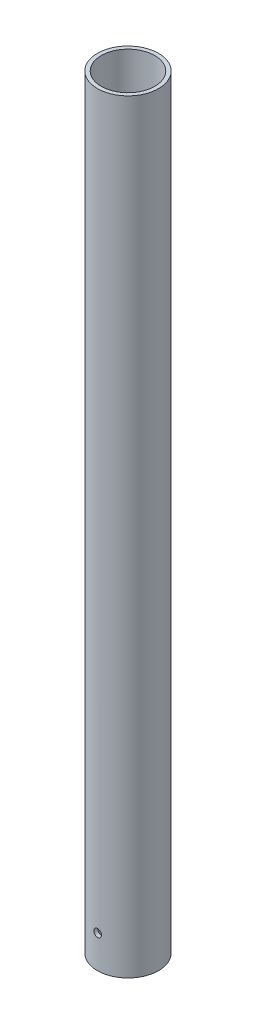
ISO-10303-21;
HEADER;
FILE_DESCRIPTION(('STEP AP214'),'2;1');
FILE_NAME('part.step','',(''),(''),'','','');
FILE_SCHEMA(('AUTOMOTIVE_DESIGN { 1 0 10303 214 1 1 1 1 }'));
ENDSEC;
DATA;
#1=APPLICATION_CONTEXT('core data for automotive mechanical design processes');
#2=APPLICATION_PROTOCOL_DEFINITION('international standard','automotive_design',2000,#1);
#3=PRODUCT_CONTEXT('',#1,'mechanical');
#4=PRODUCT('Part','Part','',(#3));
#5=PRODUCT_RELATED_PRODUCT_CATEGORY('part','',(#4));
#6=PRODUCT_DEFINITION_FORMATION('','',#4);
#7=PRODUCT_DEFINITION_CONTEXT('part definition',#1,'design');
#8=PRODUCT_DEFINITION('design','',#6,#7);
#9=PRODUCT_DEFINITION_SHAPE('','',#8);
#10=(LENGTH_UNIT() NAMED_UNIT(*) SI_UNIT(.MILLI.,.METRE.));
#11=(NAMED_UNIT(*) PLANE_ANGLE_UNIT() SI_UNIT($,.RADIAN.));
#12=(NAMED_UNIT(*) SI_UNIT($,.STERADIAN.) SOLID_ANGLE_UNIT());
#13=UNCERTAINTY_MEASURE_WITH_UNIT(LENGTH_MEASURE(1.E-05),#10,'distance_accuracy_value','');
#14=(GEOMETRIC_REPRESENTATION_CONTEXT(3) GLOBAL_UNCERTAINTY_ASSIGNED_CONTEXT((#13)) GLOBAL_UNIT_ASSIGNED_CONTEXT((#10,
#11,#12)) REPRESENTATION_CONTEXT('',''));
#15=CARTESIAN_POINT('',(0.,0.,0.));
#16=DIRECTION('',(0.,0.,1.));
#17=DIRECTION('',(1.,0.,0.));
#18=AXIS2_PLACEMENT_3D('',#15,#16,#17);
#19=CARTESIAN_POINT('',(0.,200.,0.));
#20=DIRECTION('',(0.,1.,0.));
#21=DIRECTION('',(0.,0.,1.));
#22=AXIS2_PLACEMENT_3D('',#19,#20,#21);
#23=PLANE('',#22);
#24=CARTESIAN_POINT('',(0.,200.,0.));
#25=DIRECTION('',(0.,1.,0.));
#26=DIRECTION('',(0.,0.,1.));
#27=AXIS2_PLACEMENT_3D('',#24,#25,#26);
#28=CIRCLE('',#27,8.);
#29=CARTESIAN_POINT('',(0.,200.,8.));
#30=VERTEX_POINT('',#29);
#31=EDGE_CURVE('E10',#30,#30,#28,.T.);
#32=ORIENTED_EDGE('',*,*,#31,.T.);
#33=EDGE_LOOP('',(#32));
#34=FACE_BOUND('',#33,.T.);
#35=CARTESIAN_POINT('',(0.,200.,0.));
#36=DIRECTION('',(0.,1.,0.));
#37=DIRECTION('',(0.,0.,1.));
#38=AXIS2_PLACEMENT_3D('',#35,#36,#37);
#39=CIRCLE('',#38,7.);
#40=CARTESIAN_POINT('',(0.,200.,7.));
#41=VERTEX_POINT('',#40);
#42=EDGE_CURVE('E52',#41,#41,#39,.T.);
#43=ORIENTED_EDGE('',*,*,#42,.F.);
#44=EDGE_LOOP('',(#43));
#45=FACE_BOUND('',#44,.T.);
#46=ADVANCED_FACE('F33',(#34,#45),#23,.T.);
#47=CARTESIAN_POINT('',(0.,0.,0.));
#48=DIRECTION('',(0.,1.,0.));
#49=DIRECTION('',(0.,0.,1.));
#50=AXIS2_PLACEMENT_3D('',#47,#48,#49);
#51=PLANE('',#50);
#52=CARTESIAN_POINT('',(0.,0.,0.));
#53=DIRECTION('',(0.,1.,0.));
#54=DIRECTION('',(0.,0.,1.));
#55=AXIS2_PLACEMENT_3D('',#52,#53,#54);
#56=CIRCLE('',#55,8.);
#57=CARTESIAN_POINT('',(0.,0.,8.));
#58=VERTEX_POINT('',#57);
#59=EDGE_CURVE('E47',#58,#58,#56,.T.);
#60=ORIENTED_EDGE('',*,*,#59,.F.);
#61=EDGE_LOOP('',(#60));
#62=FACE_BOUND('',#61,.T.);
#63=CARTESIAN_POINT('',(0.,0.,0.));
#64=DIRECTION('',(0.,1.,0.));
#65=DIRECTION('',(0.,0.,1.));
#66=AXIS2_PLACEMENT_3D('',#63,#64,#65);
#67=CIRCLE('',#66,7.);
#68=CARTESIAN_POINT('',(0.,0.,7.));
#69=VERTEX_POINT('',#68);
#70=EDGE_CURVE('E55',#69,#69,#67,.T.);
#71=ORIENTED_EDGE('',*,*,#70,.T.);
#72=EDGE_LOOP('',(#71));
#73=FACE_BOUND('',#72,.T.);
#74=ADVANCED_FACE('F91',(#62,#73),#51,.F.);
#75=CARTESIAN_POINT('',(0.,200.,0.));
#76=DIRECTION('',(0.,-1.,0.));
#77=DIRECTION('',(0.,0.,-1.));
#78=AXIS2_PLACEMENT_3D('',#75,#76,#77);
#79=CYLINDRICAL_SURFACE('',#78,8.);
#80=CARTESIAN_POINT('',(0.,9.56358164041707,-8.));
#81=CARTESIAN_POINT('',(-0.0559364382223049,9.56357926404278,-7.99999921958571));
#82=CARTESIAN_POINT('',(-0.1119078297211,9.55887248874936,-7.99940713821961));
#83=CARTESIAN_POINT('',(-0.222293120835902,9.54017053858876,-7.99710216044544));
#84=CARTESIAN_POINT('',(-0.276705332249498,9.52616566524772,-7.99538809376571));
#85=CARTESIAN_POINT('',(-0.382358229925222,9.48928658285144,-7.99103224417762));
#86=CARTESIAN_POINT('',(-0.433601024058456,9.46641834369313,-7.98839108582217));
#87=CARTESIAN_POINT('',(-0.531511789957215,9.41247472682916,-7.98247480351239));
#88=CARTESIAN_POINT('',(-0.578180544622548,9.38140075700479,-7.97919978833646));
#89=CARTESIAN_POINT('',(-0.665885126772527,9.31174486048124,-7.9723612852253));
#90=CARTESIAN_POINT('',(-0.706892145974851,9.27312678867858,-7.96879645876967));
#91=CARTESIAN_POINT('',(-0.781861117422998,9.18955651100242,-7.961790904039));
#92=CARTESIAN_POINT('',(-0.815822710556901,9.14460398245178,-7.95835018209707));
#93=CARTESIAN_POINT('',(-0.875844064513576,9.04945364939081,-7.95196922247834));
#94=CARTESIAN_POINT('',(-0.901876838376429,8.9992386957899,-7.94903070871164));
#95=CARTESIAN_POINT('',(-0.945129230630047,8.89510681963813,-7.94400451383073));
#96=CARTESIAN_POINT('',(-0.962349183226087,8.84119003755827,-7.94191680045254));
#97=CARTESIAN_POINT('',(-0.987399592009906,8.73148396218237,-7.93884135841445));
#98=CARTESIAN_POINT('',(-0.995278685892681,8.6757059373354,-7.93784793374698));
#99=CARTESIAN_POINT('',(-1.00157421982289,8.56361113502834,-7.93705611257117));
#100=CARTESIAN_POINT('',(-0.999991040400967,8.50729437932456,-7.93725766800603));
#101=CARTESIAN_POINT('',(-0.987446894579162,8.39605970951756,-7.93882782147901));
#102=CARTESIAN_POINT('',(-0.976539505193879,8.34113564593697,-7.94018975184131));
#103=CARTESIAN_POINT('',(-0.945740153272821,8.23390363192948,-7.94391679903051));
#104=CARTESIAN_POINT('',(-0.925848008700761,8.18159573453146,-7.94628193618289));
#105=CARTESIAN_POINT('',(-0.87758622396466,8.0809144408084,-7.9517564634586));
#106=CARTESIAN_POINT('',(-0.849193301483055,8.03255232031748,-7.95486789284578));
#107=CARTESIAN_POINT('',(-0.784752587782768,7.94125896265178,-7.96148284572239));
#108=CARTESIAN_POINT('',(-0.74870444643231,7.8983279740276,-7.96498638714265));
#109=CARTESIAN_POINT('',(-0.669679644301511,7.81880455612798,-7.9720204395617));
#110=CARTESIAN_POINT('',(-0.626656803136005,7.78225800371068,-7.97555096954756));
#111=CARTESIAN_POINT('',(-0.535062867645569,7.71689808840486,-7.98221853022341));
#112=CARTESIAN_POINT('',(-0.4864917605273,7.68808474334827,-7.98535556000602));
#113=CARTESIAN_POINT('',(-0.385144668545392,7.63900911223151,-7.99088460887432));
#114=CARTESIAN_POINT('',(-0.332367278135086,7.61874969886458,-7.99327637760615));
#115=CARTESIAN_POINT('',(-0.224123176172422,7.58739344300777,-7.99704314312025));
#116=CARTESIAN_POINT('',(-0.168656590652267,7.57629617156225,-7.99841818750348));
#117=CARTESIAN_POINT('',(-0.0570052655653988,7.56363867071285,-7.99999038564304));
#118=CARTESIAN_POINT('',(-0.000827796079442673,7.56201524347145,-8.00019534457054));
#119=CARTESIAN_POINT('',(0.110998414598999,7.56818473403945,-7.99942535202172));
#120=CARTESIAN_POINT('',(0.166647167025883,7.57597745131771,-7.99845042567285));
#121=CARTESIAN_POINT('',(0.275649803088609,7.60070552392683,-7.99543507502677));
#122=CARTESIAN_POINT('',(0.329010628169883,7.61761074577813,-7.99339816325548));
#123=CARTESIAN_POINT('',(0.432139861943363,7.66005262118224,-7.98848689240079));
#124=CARTESIAN_POINT('',(0.481908148586126,7.68558956781364,-7.98561250488249));
#125=CARTESIAN_POINT('',(0.576721808274971,7.74472289542006,-7.97932729164045));
#126=CARTESIAN_POINT('',(0.621741503977528,7.77836015633933,-7.97591377617004));
#127=CARTESIAN_POINT('',(0.705518795850528,7.85268143943076,-7.96894056930262));
#128=CARTESIAN_POINT('',(0.744276143334744,7.89336574131747,-7.96538087210759));
#129=CARTESIAN_POINT('',(0.814652783527207,7.98090460711993,-7.95849242185034));
#130=CARTESIAN_POINT('',(0.846230184227174,8.02779297894123,-7.95516509888531));
#131=CARTESIAN_POINT('',(0.901061155777403,8.12624493835896,-7.94914164414859));
#132=CARTESIAN_POINT('',(0.924314893491348,8.17780843220768,-7.94644549972411));
#133=CARTESIAN_POINT('',(0.961770631546617,8.28401176807612,-7.94199940157198));
#134=CARTESIAN_POINT('',(0.975996250982844,8.33864317243627,-7.94024698073915));
#135=CARTESIAN_POINT('',(0.995067997547139,8.44954263392934,-7.93787966362982));
#136=CARTESIAN_POINT('',(0.999914561014305,8.50581061480068,-7.93726471443511));
#137=CARTESIAN_POINT('',(1.00008261443393,8.61796921209895,-7.93724350792982));
#138=CARTESIAN_POINT('',(0.99546991907971,8.67385973974983,-7.93782889900781));
#139=CARTESIAN_POINT('',(0.976989761939731,8.78406449215511,-7.94012445814881));
#140=CARTESIAN_POINT('',(0.963122299162308,8.83837871674059,-7.94183462633232));
#141=CARTESIAN_POINT('',(0.926546829475863,8.94388042312363,-7.9461844630982));
#142=CARTESIAN_POINT('',(0.903841992388374,8.9950690184258,-7.94882379837113));
#143=CARTESIAN_POINT('',(0.850242760860124,9.0929203020364,-7.95473513297927));
#144=CARTESIAN_POINT('',(0.819348263803835,9.13958293362501,-7.95800714024165));
#145=CARTESIAN_POINT('',(0.750002532506335,9.22739413055326,-7.96484241900893));
#146=CARTESIAN_POINT('',(0.711502250309983,9.26850382479907,-7.96840748833613));
#147=CARTESIAN_POINT('',(0.628140090787353,9.34370437048426,-7.9754113263716));
#148=CARTESIAN_POINT('',(0.583276715656627,9.3777935647268,-7.97885006510236));
#149=CARTESIAN_POINT('',(0.488266248341684,9.43809578325919,-7.98522822634699));
#150=CARTESIAN_POINT('',(0.438099711838467,9.46427836277678,-7.9881657003132));
#151=CARTESIAN_POINT('',(0.334073160920512,9.50781013758359,-7.9931905963069));
#152=CARTESIAN_POINT('',(0.280217232348094,9.52516893095846,-7.9952789414783));
#153=CARTESIAN_POINT('',(0.18840230878717,9.5464053756856,-7.99786688131099));
#154=CARTESIAN_POINT('',(0.151022265406769,9.5528372172099,-7.99866290358181));
#155=CARTESIAN_POINT('',(0.0757668252849746,9.56142613869436,-7.99972972531675));
#156=CARTESIAN_POINT('',(0.0378914321984112,9.56358325017679,-8.00000052865388));
#157=CARTESIAN_POINT('',(0.,9.56358164041707,-8.));
#158=B_SPLINE_CURVE_WITH_KNOTS('',3,(#80,#81,#82,#83,#84,#85,#86,#87,#88,#89,#90,#91,#92,#93,
#94,#95,#96,#97,#98,#99,#100,#101,#102,#103,#104,#105,#106,#107,#108,#109,#110,#111,#112,#113,
#114,#115,#116,#117,#118,#119,#120,#121,#122,#123,#124,#125,#126,#127,#128,#129,#130,#131,#132,
#133,#134,#135,#136,#137,#138,#139,#140,#141,#142,#143,#144,#145,#146,#147,#148,#149,#150,#151,
#152,#153,#154,#155,#156,#157),.UNSPECIFIED.,.T.,.F.,(4,2,2,2,2,2,2,2,2,2,2,2,2,2,2,2,2,2,2,2,2,
2,2,2,2,2,2,2,2,2,2,2,2,2,2,2,2,2,4),(0.,0.167670909110499,0.335516984377371,0.503250203272708,
0.670954662364292,0.839483252807371,1.00802043120004,1.17712500127548,1.34622315798723,
1.51443690114528,1.68264387953865,1.84989078576677,2.01714108066497,2.18485370514213,
2.35257400205455,2.52145391254567,2.69033421245245,2.85927118292642,3.02820024361512,
3.19600111756768,3.36379841800772,3.53104421557358,3.69829569231579,3.86640961171369,
4.03453020550035,4.20360788603029,4.37268217688615,4.5413122971237,4.70993457204249,
4.87738760480886,5.04484065551819,5.21223369882595,5.37962883964906,5.54814095076732,
5.71669279388005,5.88588561214741,6.05489399473613,6.16847537275051,6.28205591320175),.UNSPECIFIED.);
#159=CARTESIAN_POINT('',(0.,9.56358164041707,-8.));
#160=VERTEX_POINT('',#159);
#161=EDGE_CURVE('E80',#160,#160,#158,.T.);
#162=ORIENTED_EDGE('',*,*,#161,.T.);
#163=EDGE_LOOP('',(#162));
#164=FACE_BOUND('',#163,.T.);
#165=CARTESIAN_POINT('',(1.,8.56358164041708,7.93725393319377));
#166=CARTESIAN_POINT('',(0.99999762193358,8.50764712690034,7.93725473668531));
#167=CARTESIAN_POINT('',(0.995291159608515,8.45167765445515,7.93785158047578));
#168=CARTESIAN_POINT('',(0.976590565488537,8.34129635025523,7.94017356391988));
#169=CARTESIAN_POINT('',(0.962586728436518,8.28688620821826,7.94189988257185));
#170=CARTESIAN_POINT('',(0.925710677130384,8.18123768757066,7.94628229510171));
#171=CARTESIAN_POINT('',(0.902844481919297,8.12999718356961,7.9489377578146));
#172=CARTESIAN_POINT('',(0.848905679371812,8.03209025968784,7.95487849407963));
#173=CARTESIAN_POINT('',(0.817834474949917,7.98542305971985,7.95816365993713));
#174=CARTESIAN_POINT('',(0.748181380105768,7.89771674156822,7.9650142369756));
#175=CARTESIAN_POINT('',(0.70956272600972,7.85670691948952,7.96858096680817));
#176=CARTESIAN_POINT('',(0.625990104268492,7.78173253284144,7.97558093150333));
#177=CARTESIAN_POINT('',(0.581035821623214,7.7477683187792,7.97901415971753));
#178=CARTESIAN_POINT('',(0.485883932270388,7.68774420861453,7.98537377845129));
#179=CARTESIAN_POINT('',(0.435669478224445,7.66171082237721,7.98829845538722));
#180=CARTESIAN_POINT('',(0.331538687222366,7.61845716044069,7.99329694781811));
#181=CARTESIAN_POINT('',(0.277622487744362,7.60123655764647,7.99537079489187));
#182=CARTESIAN_POINT('',(0.167918275100445,7.5761848130833,7.99842467482491));
#183=CARTESIAN_POINT('',(0.112141543865351,7.56830496900752,7.99941037934376));
#184=CARTESIAN_POINT('',(4.92802746185017E-05,7.56200748640246,8.00019627891687));
#185=CARTESIAN_POINT('',(-0.0562662307979085,7.56358947563606,7.99999652060831));
#186=CARTESIAN_POINT('',(-0.167506107589819,7.57613172152004,7.99843859108004));
#187=CARTESIAN_POINT('',(-0.222436482305781,7.58703959980962,7.99708688982291));
#188=CARTESIAN_POINT('',(-0.32968086556215,7.61784211106905,7.99338422376933));
#189=CARTESIAN_POINT('',(-0.381994824342482,7.63773691488381,7.99103323997618));
#190=CARTESIAN_POINT('',(-0.482683526175456,7.68600423753059,7.98558503123165));
#191=CARTESIAN_POINT('',(-0.531047291136208,7.71439942350915,7.98248581537295));
#192=CARTESIAN_POINT('',(-0.622342980922591,7.77884498530349,7.97588787626113));
#193=CARTESIAN_POINT('',(-0.665274656486943,7.8148957122045,7.97238913468905));
#194=CARTESIAN_POINT('',(-0.744795212309178,7.89392236785643,7.96535547009405));
#195=CARTESIAN_POINT('',(-0.781338735998399,7.93694394423574,7.96182046321891));
#196=CARTESIAN_POINT('',(-0.846693140250043,8.02853426313006,7.95513628776232));
#197=CARTESIAN_POINT('',(-0.875503996574039,8.0771030230323,7.95198712039032));
#198=CARTESIAN_POINT('',(-0.924577829433094,8.17844943864201,7.94643121045087));
#199=CARTESIAN_POINT('',(-0.944837171944931,8.23122887239835,7.94402478363252));
#200=CARTESIAN_POINT('',(-0.976192661787235,8.33947742182781,7.94023296998382));
#201=CARTESIAN_POINT('',(-0.987289250719848,8.39494640774056,7.93884753394681));
#202=CARTESIAN_POINT('',(-0.999944172763444,8.50659891321698,7.9372635551362));
#203=CARTESIAN_POINT('',(-1.00156633679931,8.56277508965259,7.9370570697695));
#204=CARTESIAN_POINT('',(-0.995394781292224,8.67459841228324,7.93783336447859));
#205=CARTESIAN_POINT('',(-0.987601262443924,8.7302455697288,7.9388161192058));
#206=CARTESIAN_POINT('',(-0.962873314319092,8.83923994584822,7.94185291393595));
#207=CARTESIAN_POINT('',(-0.945969793498425,8.89259428649324,7.94390333077864));
#208=CARTESIAN_POINT('',(-0.903533487646452,8.99571130235834,7.94884147988323));
#209=CARTESIAN_POINT('',(-0.878000399432491,9.04547385131342,7.95172924156306));
#210=CARTESIAN_POINT('',(-0.818872808861969,9.14028349794227,7.95803572541294));
#211=CARTESIAN_POINT('',(-0.785236447830843,9.18530430654284,7.96145717094833));
#212=CARTESIAN_POINT('',(-0.710916296947582,9.26908426199109,7.96843695820409));
#213=CARTESIAN_POINT('',(-0.670232232970194,9.30784316516427,7.97199530524515));
#214=CARTESIAN_POINT('',(-0.582692710223409,9.37822331535084,7.97887235474784));
#215=CARTESIAN_POINT('',(-0.535803396846813,9.40980261913507,7.98218957565009));
#216=CARTESIAN_POINT('',(-0.437349032672715,9.46463692747059,7.98818845212644));
#217=CARTESIAN_POINT('',(-0.385784076147329,9.48789209980946,7.99087012051086));
#218=CARTESIAN_POINT('',(-0.279581543655782,9.52534875518029,7.99528916261275));
#219=CARTESIAN_POINT('',(-0.224952626604711,9.53957447882972,7.99702906275082));
#220=CARTESIAN_POINT('',(-0.114058422911184,9.55864727610778,7.99937901871026));
#221=CARTESIAN_POINT('',(-0.0577932101752427,9.56349477265677,7.99998912548071));
#222=CARTESIAN_POINT('',(0.0543668733375137,9.56366560933394,8.00001051205466));
#223=CARTESIAN_POINT('',(0.110261655085894,9.55905362464426,7.99942993267136));
#224=CARTESIAN_POINT('',(0.220475096581045,9.54057339504474,7.99715136463176));
#225=CARTESIAN_POINT('',(0.27479375742394,9.52670515657237,7.99545337675258));
#226=CARTESIAN_POINT('',(0.380304577194926,9.4901263946772,7.99112994084813));
#227=CARTESIAN_POINT('',(0.431497824063828,9.46741896866778,7.98850481773788));
#228=CARTESIAN_POINT('',(0.529357334857609,9.41381311457405,7.98261779042513));
#229=CARTESIAN_POINT('',(0.576023544955212,9.3829145891124,7.97935587865248));
#230=CARTESIAN_POINT('',(0.663834707185023,9.31356435428252,7.97253277570231));
#231=CARTESIAN_POINT('',(0.70494151513372,9.27506452300761,7.96896976511568));
#232=CARTESIAN_POINT('',(0.780136447527738,9.19170446280553,7.96196063605416));
#233=CARTESIAN_POINT('',(0.814222907117396,9.14684272942071,7.95851454546799));
#234=CARTESIAN_POINT('',(0.874522097006414,9.05183367133813,7.95211524557875));
#235=CARTESIAN_POINT('',(0.900703913266694,9.00166660444304,7.94916399100913));
#236=CARTESIAN_POINT('',(0.944234115337341,8.89763894417917,7.94411143247849));
#237=CARTESIAN_POINT('',(0.961592108491325,8.84378244069572,7.94200920461551));
#238=CARTESIAN_POINT('',(0.982826358495191,8.75196964559966,7.93940314727937));
#239=CARTESIAN_POINT('',(0.989257212404232,8.71459245980204,7.93860120608764));
#240=CARTESIAN_POINT('',(0.997844822362205,8.6393427404303,7.93752632891965));
#241=CARTESIAN_POINT('',(1.00000161083973,8.60147021061669,7.93725338892971));
#242=CARTESIAN_POINT('',(1.,8.56358164041708,7.93725393319377));
#243=B_SPLINE_CURVE_WITH_KNOTS('',3,(#165,#166,#167,#168,#169,#170,#171,#172,#173,#174,#175,
#176,#177,#178,#179,#180,#181,#182,#183,#184,#185,#186,#187,#188,#189,#190,#191,#192,#193,#194,
#195,#196,#197,#198,#199,#200,#201,#202,#203,#204,#205,#206,#207,#208,#209,#210,#211,#212,#213,
#214,#215,#216,#217,#218,#219,#220,#221,#222,#223,#224,#225,#226,#227,#228,#229,#230,#231,#232,
#233,#234,#235,#236,#237,#238,#239,#240,#241,#242),.UNSPECIFIED.,.T.,.F.,(4,2,2,2,2,2,2,2,2,2,2,
2,2,2,2,2,2,2,2,2,2,2,2,2,2,2,2,2,2,2,2,2,2,2,2,2,2,2,4),(0.,0.167665126991696,
0.335505550460953,0.50323218103248,0.67093015180245,0.839466310196264,1.00801085097032,
1.17711274458296,1.34620836135932,1.51441838776583,1.68262179668044,1.84988665973216,
2.01715470268716,2.18487281765122,2.35259862587642,2.52147078951108,2.6903434824777,
2.85928786695604,3.02822410862476,3.19602087122353,3.36381405730846,3.53104150517093,
3.69827482884741,3.86639127817645,4.03451426797925,4.20359554356937,4.37267341083552,
4.54129542713977,4.70990983909125,4.87737526515302,5.04484057474716,5.21224725417636,
5.379655923857,5.54816051556335,5.71670502175932,5.88590039081934,6.05491114392807,
6.1684839585318,6.2820559114219),.UNSPECIFIED.);
#244=CARTESIAN_POINT('',(1.,8.56358164041708,7.93725393319377));
#245=VERTEX_POINT('',#244);
#246=EDGE_CURVE('E75',#245,#245,#243,.T.);
#247=ORIENTED_EDGE('',*,*,#246,.T.);
#248=EDGE_LOOP('',(#247));
#249=FACE_BOUND('',#248,.T.);
#250=ORIENTED_EDGE('',*,*,#31,.F.);
#251=EDGE_LOOP('',(#250));
#252=FACE_BOUND('',#251,.T.);
#253=ORIENTED_EDGE('',*,*,#59,.T.);
#254=EDGE_LOOP('',(#253));
#255=FACE_BOUND('',#254,.T.);
#256=ADVANCED_FACE('F35',(#164,#249,#252,#255),#79,.T.);
#257=CARTESIAN_POINT('',(0.,200.,0.));
#258=DIRECTION('',(0.,-1.,0.));
#259=DIRECTION('',(0.,0.,-1.));
#260=AXIS2_PLACEMENT_3D('',#257,#258,#259);
#261=CYLINDRICAL_SURFACE('',#260,7.);
#262=CARTESIAN_POINT('',(0.,9.56358164041707,-7.));
#263=CARTESIAN_POINT('',(-0.055865364706411,9.56357931382826,-6.99999913522882));
#264=CARTESIAN_POINT('',(-0.111763905495517,9.55888443325767,-6.99932420200296));
#265=CARTESIAN_POINT('',(-0.222000660368082,9.54023250418308,-6.99669670505877));
#266=CARTESIAN_POINT('',(-0.276337265533479,9.52626623864669,-6.99474286996306));
#267=CARTESIAN_POINT('',(-0.381838676785442,9.48949557868285,-6.98977730161823));
#268=CARTESIAN_POINT('',(-0.433005769349771,9.46669764359057,-6.98676634168295));
#269=CARTESIAN_POINT('',(-0.530779650240318,9.41292609752172,-6.98001989080586));
#270=CARTESIAN_POINT('',(-0.57738711543865,9.38195370256749,-6.97628450765023));
#271=CARTESIAN_POINT('',(-0.665058650397312,9.31247746924981,-6.96847539120891));
#272=CARTESIAN_POINT('',(-0.70608559080065,9.27392699755916,-6.96439965767478));
#273=CARTESIAN_POINT('',(-0.781111291768627,9.19048922587742,-6.95638499821218));
#274=CARTESIAN_POINT('',(-0.815109662708697,9.14560157482055,-6.95244607987804));
#275=CARTESIAN_POINT('',(-0.875255876422228,9.05051652436332,-6.94513156490684));
#276=CARTESIAN_POINT('',(-0.901368125473884,9.00029639413192,-6.94175855199628));
#277=CARTESIAN_POINT('',(-0.944773451668099,8.89612710092602,-6.93598482656287));
#278=CARTESIAN_POINT('',(-0.962066964544984,8.84217812234375,-6.93358406600217));
#279=CARTESIAN_POINT('',(-0.987229320061167,8.73247163058906,-6.93004619376593));
#280=CARTESIAN_POINT('',(-0.995161488527954,8.67672892048925,-6.92890059523603));
#281=CARTESIAN_POINT('',(-1.00157210007568,8.56469273498227,-6.92797693845422));
#282=CARTESIAN_POINT('',(-1.00005103626979,8.50839928845635,-6.92819880887042));
#283=CARTESIAN_POINT('',(-0.98765018097941,8.397305095084,-6.9299772577103));
#284=CARTESIAN_POINT('',(-0.976840681796494,8.34249631837122,-6.9315238110212));
#285=CARTESIAN_POINT('',(-0.946279723214286,8.23547855413281,-6.93576171689508));
#286=CARTESIAN_POINT('',(-0.926528032474813,8.18326963390591,-6.9384530990754));
#287=CARTESIAN_POINT('',(-0.878569521249536,8.08271836730865,-6.94468857735278));
#288=CARTESIAN_POINT('',(-0.85033269311634,8.03439052803127,-6.94823569081255));
#289=CARTESIAN_POINT('',(-0.78622684572038,7.94313242822777,-6.95578073890064));
#290=CARTESIAN_POINT('',(-0.750357371512553,7.90020248968713,-6.95977870039515));
#291=CARTESIAN_POINT('',(-0.671617458714389,7.82055123730244,-6.9678193568045));
#292=CARTESIAN_POINT('',(-0.628686537577609,7.78388969535712,-6.97186212884533));
#293=CARTESIAN_POINT('',(-0.537249159400889,7.71828313919381,-6.97950317895594));
#294=CARTESIAN_POINT('',(-0.488742681872489,7.68933815333311,-6.98310145539225));
#295=CARTESIAN_POINT('',(-0.387481039813844,7.63998420291778,-6.98945135313469));
#296=CARTESIAN_POINT('',(-0.334723727733654,7.61957958566994,-6.99220254306019));
#297=CARTESIAN_POINT('',(-0.226483349377097,7.58793617109733,-6.99654459946019));
#298=CARTESIAN_POINT('',(-0.171000450315641,7.57669681222616,-6.99813553702157));
#299=CARTESIAN_POINT('',(-0.0594000111949726,7.56378182700686,-6.99996847286368));
#300=CARTESIAN_POINT('',(-0.00329216977119532,7.56202397718283,-7.00022206812239));
#301=CARTESIAN_POINT('',(0.108417425156648,7.56790404442712,-6.9993832363385));
#302=CARTESIAN_POINT('',(0.16401919278803,7.57554169839962,-6.99829084698658));
#303=CARTESIAN_POINT('',(0.272891208992244,7.59992761121443,-6.99488996866151));
#304=CARTESIAN_POINT('',(0.326170552460062,7.61663607000685,-6.99258679365044));
#305=CARTESIAN_POINT('',(0.429171472012341,7.65864751006478,-6.98702187136217));
#306=CARTESIAN_POINT('',(0.478892894540541,7.68395086200664,-6.98376008274315));
#307=CARTESIAN_POINT('',(0.573729847898929,7.7426285489108,-6.97661188585467));
#308=CARTESIAN_POINT('',(0.618812606348985,7.7760553552698,-6.97272147424604));
#309=CARTESIAN_POINT('',(0.702757647402431,7.8499576784432,-6.96476223215387));
#310=CARTESIAN_POINT('',(0.741619603539292,7.89043356495941,-6.96069339232073));
#311=CARTESIAN_POINT('',(0.812316823103835,7.97764999089931,-6.95279940084852));
#312=CARTESIAN_POINT('',(0.844097150424189,8.02443527556734,-6.94897630774254));
#313=CARTESIAN_POINT('',(0.899347843769573,8.12272823371907,-6.94204235740405));
#314=CARTESIAN_POINT('',(0.922818417525415,8.17423578911288,-6.9389314823679));
#315=CARTESIAN_POINT('',(0.960697053792666,8.28034329267022,-6.9337888513088));
#316=CARTESIAN_POINT('',(0.975134650659852,8.33493251983773,-6.93175358189617));
#317=CARTESIAN_POINT('',(0.994631866000765,8.44579192094488,-6.92898304632217));
#318=CARTESIAN_POINT('',(0.999692066965096,8.50206199025592,-6.92824769941436));
#319=CARTESIAN_POINT('',(1.00027795187105,8.61413855367772,-6.92816308872538));
#320=CARTESIAN_POINT('',(0.995889986839031,8.66994460624473,-6.92880127161589));
#321=CARTESIAN_POINT('',(0.977888479253999,8.78001670244631,-6.9313646210599));
#322=CARTESIAN_POINT('',(0.964274946206753,8.83428274766759,-6.93328978628734));
#323=CARTESIAN_POINT('',(0.92823822782898,8.93971427297267,-6.93820594738757));
#324=CARTESIAN_POINT('',(0.905820514813006,8.99088165629859,-6.94119628108845));
#325=CARTESIAN_POINT('',(0.852820321015437,9.08874286289378,-6.94790672863692));
#326=CARTESIAN_POINT('',(0.822237615959197,9.13543656323277,-6.95162686252979));
#327=CARTESIAN_POINT('',(0.753459737315475,9.22346454968153,-6.95941831326445));
#328=CARTESIAN_POINT('',(0.715200464701824,9.26474851301819,-6.96349241131826));
#329=CARTESIAN_POINT('',(0.632290756660576,9.34034149413319,-6.97150911027032));
#330=CARTESIAN_POINT('',(0.587638832167471,9.37464888231132,-6.97545168026666));
#331=CARTESIAN_POINT('',(0.492951712266923,9.43546542643515,-6.98278331246282));
#332=CARTESIAN_POINT('',(0.442890858727148,9.46193496749602,-6.98616952559765));
#333=CARTESIAN_POINT('',(0.339010644185017,9.50605151242012,-6.99197878037442));
#334=CARTESIAN_POINT('',(0.285195302599489,9.52370779113327,-6.99440283401541));
#335=CARTESIAN_POINT('',(0.192605681998778,9.54562343387339,-6.99745181502523));
#336=CARTESIAN_POINT('',(0.154406949589286,9.5523476588862,-6.99840255428231));
#337=CARTESIAN_POINT('',(0.0774774606828312,9.56132754496117,-6.99967694328895));
#338=CARTESIAN_POINT('',(0.0387467099115307,9.5635832540763,-7.00000059978196));
#339=CARTESIAN_POINT('',(0.,9.56358164041707,-7.));
#340=B_SPLINE_CURVE_WITH_KNOTS('',3,(#262,#263,#264,#265,#266,#267,#268,#269,#270,#271,#272,
#273,#274,#275,#276,#277,#278,#279,#280,#281,#282,#283,#284,#285,#286,#287,#288,#289,#290,#291,
#292,#293,#294,#295,#296,#297,#298,#299,#300,#301,#302,#303,#304,#305,#306,#307,#308,#309,#310,
#311,#312,#313,#314,#315,#316,#317,#318,#319,#320,#321,#322,#323,#324,#325,#326,#327,#328,#329,
#330,#331,#332,#333,#334,#335,#336,#337,#338,#339),.UNSPECIFIED.,.T.,.F.,(4,2,2,2,2,2,2,2,2,2,2,
2,2,2,2,2,2,2,2,2,2,2,2,2,2,2,2,2,2,2,2,2,2,2,2,2,2,2,4),(0.,0.167454526676439,
0.335075775995835,0.502574660696852,0.670048642505171,0.838587434288067,1.00713556641494,
1.17643344042558,1.34572294860658,1.51386059320977,1.68198946724779,1.84885708289861,
2.01572901576746,2.18319817810949,2.35067732527464,2.51967378353348,2.6886708628223,
2.85775386243831,3.02682650172624,3.19443056043042,3.3620299259403,3.5288997886847,
3.69577684902495,3.86376187993315,4.03175572377582,4.20101062362346,4.37026129206513,
4.53895564370425,4.70763951629676,4.87478825923561,5.0419368299494,5.20898167202542,
5.37603110293353,5.54453823754737,5.71308468724557,5.88246902499656,6.05167472923067,
6.1678179205788,6.28395986295406),.UNSPECIFIED.);
#341=CARTESIAN_POINT('',(0.,9.56358164041707,-7.));
#342=VERTEX_POINT('',#341);
#343=EDGE_CURVE('E38',#342,#342,#340,.T.);
#344=ORIENTED_EDGE('',*,*,#343,.F.);
#345=EDGE_LOOP('',(#344));
#346=FACE_BOUND('',#345,.T.);
#347=CARTESIAN_POINT('',(1.,8.56358164041708,6.92820323027551));
#348=CARTESIAN_POINT('',(0.999997670580239,8.50771955480143,6.928204128687));
#349=CARTESIAN_POINT('',(0.995303322536939,8.45182428404449,6.92888616041897));
#350=CARTESIAN_POINT('',(0.976653700691918,8.34159432221808,6.93153899622431));
#351=CARTESIAN_POINT('',(0.962689198108791,8.28726124266202,6.93351108456814));
#352=CARTESIAN_POINT('',(0.925923694181395,8.18176729039819,6.93851621306341));
#353=CARTESIAN_POINT('',(0.903129235610144,8.13060410136562,6.941548467497));
#354=CARTESIAN_POINT('',(0.849365879446308,8.03283677568424,6.94833133303147));
#355=CARTESIAN_POINT('',(0.818398189503691,7.98623196689725,6.95208183798356));
#356=CARTESIAN_POINT('',(0.748926734200913,7.89855749249309,6.95990912626669));
#357=CARTESIAN_POINT('',(0.710375282136627,7.85752578348404,6.96398787236068));
#358=CARTESIAN_POINT('',(0.626933539483591,7.78249086179687,6.97199451559518));
#359=CARTESIAN_POINT('',(0.582042910925568,7.74848802409696,6.97592240467862));
#360=CARTESIAN_POINT('',(0.486955192010241,7.68833709153721,6.98320518511365));
#361=CARTESIAN_POINT('',(0.436735883108045,7.66222378315785,6.98655751146715));
#362=CARTESIAN_POINT('',(0.33256837298155,7.61881627275317,6.99228975726475));
#363=CARTESIAN_POINT('',(0.278620351019665,7.60152164709338,6.99466972341828));
#364=CARTESIAN_POINT('',(0.168917031770475,7.57635703693494,6.99817525004484));
#365=CARTESIAN_POINT('',(0.113176562534939,7.56842360543395,6.99930925159054));
#366=CARTESIAN_POINT('',(0.00114478263919971,7.56200969113377,7.00022397741917));
#367=CARTESIAN_POINT('',(-0.0551464999702894,7.56352872943402,7.00000477026116));
#368=CARTESIAN_POINT('',(-0.166249496092935,7.57592632952498,6.99824454731631));
#369=CARTESIAN_POINT('',(-0.221068999885517,7.58673663985833,6.99671317066214));
#370=CARTESIAN_POINT('',(-0.328107797564347,7.61730292026668,6.99251142706317));
#371=CARTESIAN_POINT('',(-0.380327029630942,7.63705910291097,6.98984103305346));
#372=CARTESIAN_POINT('',(-0.480890983383869,7.68502701280886,6.98364470185491));
#373=CARTESIAN_POINT('',(-0.529221696395534,7.71326771597649,6.98011584085856));
#374=CARTESIAN_POINT('',(-0.620483910068823,7.77738188678721,6.97259633348114));
#375=CARTESIAN_POINT('',(-0.663415087705915,7.81325581073868,6.96860565949974));
#376=CARTESIAN_POINT('',(-0.74306149553193,7.89199894125507,6.96056602471901));
#377=CARTESIAN_POINT('',(-0.779717846660919,7.93492770679167,6.95651686155615));
#378=CARTESIAN_POINT('',(-0.845314947950617,8.02635890113182,6.94885146937832));
#379=CARTESIAN_POINT('',(-0.874255658580893,8.07486135848988,6.94523524258153));
#380=CARTESIAN_POINT('',(-0.923606507603974,8.17612178537016,6.93884526841462));
#381=CARTESIAN_POINT('',(-0.94401100125889,8.22888254335838,6.93607207884933));
#382=CARTESIAN_POINT('',(-0.975653118541602,8.33713043033002,6.93169232904474));
#383=CARTESIAN_POINT('',(-0.986891325401513,8.39261738561285,6.93008569458064));
#384=CARTESIAN_POINT('',(-0.999801953440969,8.50421990913209,6.92823490378659));
#385=CARTESIAN_POINT('',(-1.00155765552236,8.56032565341487,6.92797888601553));
#386=CARTESIAN_POINT('',(-0.995674041235603,8.67203054292965,6.92882686266357));
#387=CARTESIAN_POINT('',(-0.988034988416851,8.72762970232872,6.92993081893156));
#388=CARTESIAN_POINT('',(-0.963649189276007,8.8364877304313,6.93336348262582));
#389=CARTESIAN_POINT('',(-0.946943579222102,8.88975600394975,6.93568665672625));
#390=CARTESIAN_POINT('',(-0.904941530857316,8.99273603914532,6.94129145606085));
#391=CARTESIAN_POINT('',(-0.879644704850706,9.04244764019794,6.94457312454805));
#392=CARTESIAN_POINT('',(-0.820976801656128,9.13727758027782,6.95175324206709));
#393=CARTESIAN_POINT('',(-0.787551600135624,9.18236212102325,6.95565576226152));
#394=CARTESIAN_POINT('',(-0.713651389106823,9.26631150222983,6.96362545432963));
#395=CARTESIAN_POINT('',(-0.673176019101082,9.30517602444664,6.96769263461473));
#396=CARTESIAN_POINT('',(-0.585958543142677,9.37587924963397,6.97557026206955));
#397=CARTESIAN_POINT('',(-0.539171586062165,9.40766290157684,6.97937854780926));
#398=CARTESIAN_POINT('',(-0.440874352385597,9.46291942198494,6.98627610779902));
#399=CARTESIAN_POINT('',(-0.389364195088228,9.48639250028605,6.98936540020244));
#400=CARTESIAN_POINT('',(-0.283257962296966,9.52427269757493,6.99446738922221));
#401=CARTESIAN_POINT('',(-0.228672999561964,9.53871043473082,6.99648371828611));
#402=CARTESIAN_POINT('',(-0.117822629522892,9.55820937397038,6.99922779558263));
#403=CARTESIAN_POINT('',(-0.0615573226571386,9.563271135344,6.99995562067618));
#404=CARTESIAN_POINT('',(0.0505215653135791,9.56386175988931,7.00004003835958));
#405=CARTESIAN_POINT('',(0.106334710875292,9.55947504992629,6.99940877511198));
#406=CARTESIAN_POINT('',(0.216421316739936,9.54147356539556,6.99687032137522));
#407=CARTESIAN_POINT('',(0.270694780677721,9.52785881261514,6.99496313389852));
#408=CARTESIAN_POINT('',(0.376141857248626,9.49181665170298,6.99008611027128));
#409=CARTESIAN_POINT('',(0.427317315103493,9.46939455017471,6.98711691409834));
#410=CARTESIAN_POINT('',(0.525192852925742,9.41638306581606,6.98044280051146));
#411=CARTESIAN_POINT('',(0.571892814983276,9.38579346788802,6.97673786372185));
#412=CARTESIAN_POINT('',(0.659920974801325,9.31700778280539,6.96896523731735));
#413=CARTESIAN_POINT('',(0.701200083159928,9.27874918700083,6.96489472929535));
#414=CARTESIAN_POINT('',(0.776783583636214,9.19584286029942,6.95687111713085));
#415=CARTESIAN_POINT('',(0.811086333153649,9.1511936289188,6.95291804082458));
#416=CARTESIAN_POINT('',(0.871897617377966,9.05650892124927,6.94555543925944));
#417=CARTESIAN_POINT('',(0.898365771504986,9.00644729521156,6.94214877013918));
#418=CARTESIAN_POINT('',(0.942479512535466,8.90256549211477,6.93629814067689));
#419=CARTESIAN_POINT('',(0.960134389610676,8.84874934125831,6.93385316718016));
#420=CARTESIAN_POINT('',(0.982046275827904,8.75616342750193,6.93077646109593));
#421=CARTESIAN_POINT('',(0.988768812647753,8.71796947271218,6.92981651997027));
#422=CARTESIAN_POINT('',(0.997746457542627,8.64104954193378,6.92852959655824));
#423=CARTESIAN_POINT('',(1.00000161551829,8.6023235718926,6.92820260720181));
#424=CARTESIAN_POINT('',(1.,8.56358164041708,6.92820323027551));
#425=B_SPLINE_CURVE_WITH_KNOTS('',3,(#347,#348,#349,#350,#351,#352,#353,#354,#355,#356,#357,
#358,#359,#360,#361,#362,#363,#364,#365,#366,#367,#368,#369,#370,#371,#372,#373,#374,#375,#376,
#377,#378,#379,#380,#381,#382,#383,#384,#385,#386,#387,#388,#389,#390,#391,#392,#393,#394,#395,
#396,#397,#398,#399,#400,#401,#402,#403,#404,#405,#406,#407,#408,#409,#410,#411,#412,#413,#414,
#415,#416,#417,#418,#419,#420,#421,#422,#423,#424),.UNSPECIFIED.,.T.,.F.,(4,2,2,2,2,2,2,2,2,2,2,
2,2,2,2,2,2,2,2,2,2,2,2,2,2,2,2,2,2,2,2,2,2,2,2,2,2,2,4),(0.,0.167444674697945,0.33505629725044,
0.502543960684095,0.670006890528838,0.838558578232398,1.00711925555999,1.17641265336732,
1.3456979178424,1.51382911068039,1.6819517853778,1.84884992452451,2.01575202966586,
2.18323073819423,2.3507194612925,2.51970258991851,2.68868658429869,2.85778214664265,
3.02686694894168,3.1944643054001,3.36205696038683,3.52889550400879,3.69574157755293,
3.86373060504462,4.0317282248703,4.20098960759813,4.37024671629559,4.53892711068184,
4.70759744272481,4.87476687650763,5.04193591560681,5.20900438614292,5.37607725699724,
5.54457174653061,5.71310586267878,5.88249407755998,6.05170335943179,6.1678322598134,
6.28395986302758),.UNSPECIFIED.);
#426=CARTESIAN_POINT('',(1.,8.56358164041708,6.92820323027551));
#427=VERTEX_POINT('',#426);
#428=EDGE_CURVE('E57',#427,#427,#425,.T.);
#429=ORIENTED_EDGE('',*,*,#428,.F.);
#430=EDGE_LOOP('',(#429));
#431=FACE_BOUND('',#430,.T.);
#432=ORIENTED_EDGE('',*,*,#42,.T.);
#433=EDGE_LOOP('',(#432));
#434=FACE_BOUND('',#433,.T.);
#435=ORIENTED_EDGE('',*,*,#70,.F.);
#436=EDGE_LOOP('',(#435));
#437=FACE_BOUND('',#436,.T.);
#438=ADVANCED_FACE('F62',(#346,#431,#434,#437),#261,.F.);
#439=CARTESIAN_POINT('',(0.,8.56358164041708,-8.));
#440=DIRECTION('',(0.,0.,1.));
#441=DIRECTION('',(1.,0.,0.));
#442=AXIS2_PLACEMENT_3D('',#439,#440,#441);
#443=CYLINDRICAL_SURFACE('',#442,1.);
#444=ORIENTED_EDGE('',*,*,#428,.T.);
#445=EDGE_LOOP('',(#444));
#446=FACE_BOUND('',#445,.T.);
#447=ORIENTED_EDGE('',*,*,#246,.F.);
#448=EDGE_LOOP('',(#447));
#449=FACE_BOUND('',#448,.T.);
#450=ADVANCED_FACE('F68',(#446,#449),#443,.F.);
#451=ORIENTED_EDGE('',*,*,#343,.T.);
#452=EDGE_LOOP('',(#451));
#453=FACE_BOUND('',#452,.T.);
#454=ORIENTED_EDGE('',*,*,#161,.F.);
#455=EDGE_LOOP('',(#454));
#456=FACE_BOUND('',#455,.T.);
#457=ADVANCED_FACE('F65',(#453,#456),#443,.F.);
#458=CLOSED_SHELL('',(#46,#74,#256,#438,#450,#457));
#459=MANIFOLD_SOLID_BREP('B2',#458);
#460=ADVANCED_BREP_SHAPE_REPRESENTATION('',(#18,#459),#14);
#461=SHAPE_DEFINITION_REPRESENTATION(#9,#460);
ENDSEC;
END-ISO-10303-21;
